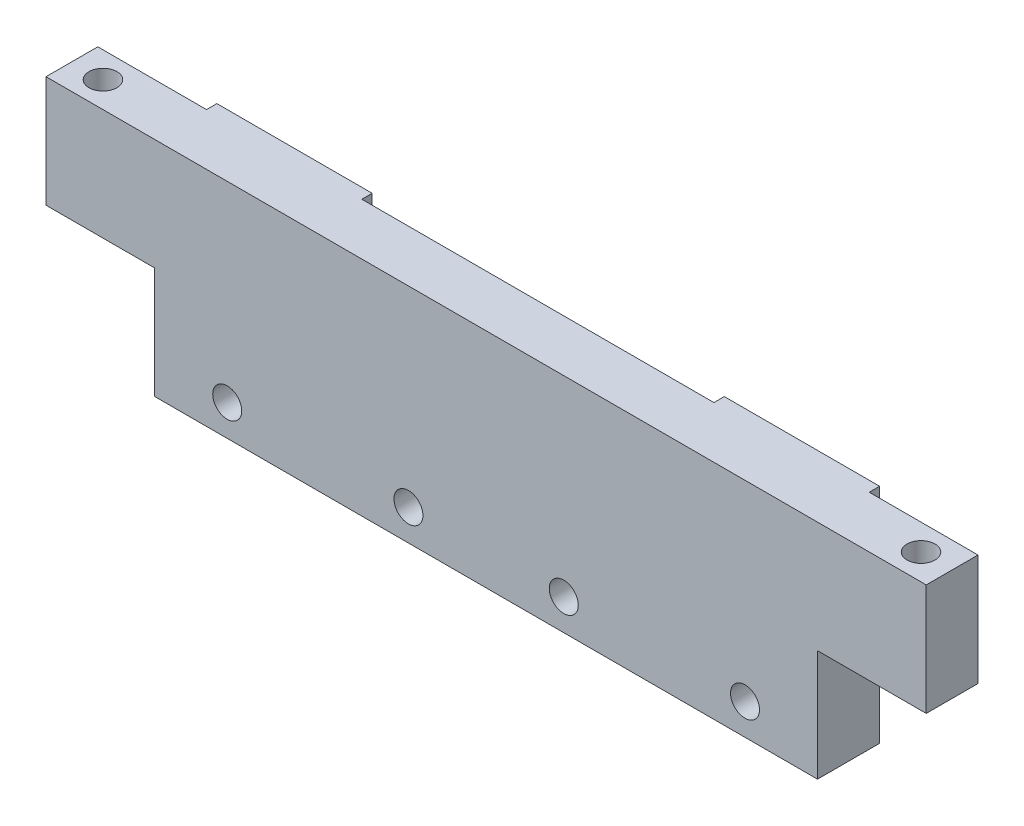
ISO-10303-21;
HEADER;
FILE_DESCRIPTION(('STEP AP214'),'2;1');
FILE_NAME('part.step','',(''),(''),'','','');
FILE_SCHEMA(('AUTOMOTIVE_DESIGN { 1 0 10303 214 1 1 1 1 }'));
ENDSEC;
DATA;
#1=APPLICATION_CONTEXT('core data for automotive mechanical design processes');
#2=APPLICATION_PROTOCOL_DEFINITION('international standard','automotive_design',2000,#1);
#3=PRODUCT_CONTEXT('',#1,'mechanical');
#4=PRODUCT('Part','Part','',(#3));
#5=PRODUCT_RELATED_PRODUCT_CATEGORY('part','',(#4));
#6=PRODUCT_DEFINITION_FORMATION('','',#4);
#7=PRODUCT_DEFINITION_CONTEXT('part definition',#1,'design');
#8=PRODUCT_DEFINITION('design','',#6,#7);
#9=PRODUCT_DEFINITION_SHAPE('','',#8);
#10=(LENGTH_UNIT() NAMED_UNIT(*) SI_UNIT(.MILLI.,.METRE.));
#11=(NAMED_UNIT(*) PLANE_ANGLE_UNIT() SI_UNIT($,.RADIAN.));
#12=(NAMED_UNIT(*) SI_UNIT($,.STERADIAN.) SOLID_ANGLE_UNIT());
#13=UNCERTAINTY_MEASURE_WITH_UNIT(LENGTH_MEASURE(1.E-05),#10,'distance_accuracy_value','');
#14=(GEOMETRIC_REPRESENTATION_CONTEXT(3) GLOBAL_UNCERTAINTY_ASSIGNED_CONTEXT((#13)) GLOBAL_UNIT_ASSIGNED_CONTEXT((#10,
#11,#12)) REPRESENTATION_CONTEXT('',''));
#15=CARTESIAN_POINT('',(0.,0.,0.));
#16=DIRECTION('',(0.,0.,1.));
#17=DIRECTION('',(1.,0.,0.));
#18=AXIS2_PLACEMENT_3D('',#15,#16,#17);
#19=CARTESIAN_POINT('',(0.,21.5,0.));
#20=DIRECTION('',(0.,-1.,0.));
#21=DIRECTION('',(0.,0.,-1.));
#22=AXIS2_PLACEMENT_3D('',#19,#20,#21);
#23=PLANE('',#22);
#24=DIRECTION('',(-1.,0.,0.));
#25=VECTOR('',#24,1.);
#26=CARTESIAN_POINT('',(-32.,21.5,-2.5));
#27=LINE('',#26,#25);
#28=CARTESIAN_POINT('',(-32.,21.5,-2.5));
#29=VERTEX_POINT('',#28);
#30=CARTESIAN_POINT('',(-42.5,21.5,-2.5));
#31=VERTEX_POINT('',#30);
#32=EDGE_CURVE('E168',#29,#31,#27,.T.);
#33=ORIENTED_EDGE('',*,*,#32,.T.);
#34=DIRECTION('',(0.,0.,1.));
#35=VECTOR('',#34,1.);
#36=CARTESIAN_POINT('',(-42.5,21.5,2.5));
#37=LINE('',#36,#35);
#38=CARTESIAN_POINT('',(-42.5,21.5,2.5));
#39=VERTEX_POINT('',#38);
#40=EDGE_CURVE('E99',#31,#39,#37,.T.);
#41=ORIENTED_EDGE('',*,*,#40,.T.);
#42=DIRECTION('',(1.,0.,0.));
#43=VECTOR('',#42,1.);
#44=CARTESIAN_POINT('',(42.5,21.5,2.5));
#45=LINE('',#44,#43);
#46=CARTESIAN_POINT('',(42.5,21.5,2.5));
#47=VERTEX_POINT('',#46);
#48=EDGE_CURVE('E254',#39,#47,#45,.T.);
#49=ORIENTED_EDGE('',*,*,#48,.T.);
#50=DIRECTION('',(0.,0.,-1.));
#51=VECTOR('',#50,1.);
#52=CARTESIAN_POINT('',(42.5,21.5,2.5));
#53=LINE('',#52,#51);
#54=CARTESIAN_POINT('',(42.5,21.5,-2.50000000000001));
#55=VERTEX_POINT('',#54);
#56=EDGE_CURVE('E256',#47,#55,#53,.T.);
#57=ORIENTED_EDGE('',*,*,#56,.T.);
#58=DIRECTION('',(-1.,0.,0.));
#59=VECTOR('',#58,1.);
#60=CARTESIAN_POINT('',(42.5,21.5,-2.50000000000001));
#61=LINE('',#60,#59);
#62=CARTESIAN_POINT('',(32.,21.5,-2.5));
#63=VERTEX_POINT('',#62);
#64=EDGE_CURVE('E258',#55,#63,#61,.T.);
#65=ORIENTED_EDGE('',*,*,#64,.T.);
#66=DIRECTION('',(0.,0.,-1.));
#67=VECTOR('',#66,1.);
#68=CARTESIAN_POINT('',(32.,21.5,-2.5));
#69=LINE('',#68,#67);
#70=CARTESIAN_POINT('',(32.,21.5,-3.5));
#71=VERTEX_POINT('',#70);
#72=EDGE_CURVE('E260',#63,#71,#69,.T.);
#73=ORIENTED_EDGE('',*,*,#72,.T.);
#74=DIRECTION('',(-1.,0.,0.));
#75=VECTOR('',#74,1.);
#76=CARTESIAN_POINT('',(32.,21.5,-3.5));
#77=LINE('',#76,#75);
#78=CARTESIAN_POINT('',(17.,21.5,-3.49999999999999));
#79=VERTEX_POINT('',#78);
#80=EDGE_CURVE('E262',#71,#79,#77,.T.);
#81=ORIENTED_EDGE('',*,*,#80,.T.);
#82=DIRECTION('',(0.,0.,1.));
#83=VECTOR('',#82,1.);
#84=CARTESIAN_POINT('',(17.,21.5,-2.5));
#85=LINE('',#84,#83);
#86=CARTESIAN_POINT('',(17.,21.5,-2.5));
#87=VERTEX_POINT('',#86);
#88=EDGE_CURVE('E264',#79,#87,#85,.T.);
#89=ORIENTED_EDGE('',*,*,#88,.T.);
#90=DIRECTION('',(-1.,0.,0.));
#91=VECTOR('',#90,1.);
#92=CARTESIAN_POINT('',(17.,21.5,-2.5));
#93=LINE('',#92,#91);
#94=CARTESIAN_POINT('',(-17.,21.5,-2.5));
#95=VERTEX_POINT('',#94);
#96=EDGE_CURVE('E133',#87,#95,#93,.T.);
#97=ORIENTED_EDGE('',*,*,#96,.T.);
#98=DIRECTION('',(0.,0.,-1.));
#99=VECTOR('',#98,1.);
#100=CARTESIAN_POINT('',(-17.,21.5,-2.5));
#101=LINE('',#100,#99);
#102=CARTESIAN_POINT('',(-17.,21.5,-3.5));
#103=VERTEX_POINT('',#102);
#104=EDGE_CURVE('E127',#95,#103,#101,.T.);
#105=ORIENTED_EDGE('',*,*,#104,.T.);
#106=DIRECTION('',(-1.,0.,0.));
#107=VECTOR('',#106,1.);
#108=CARTESIAN_POINT('',(-32.,21.5,-3.5));
#109=LINE('',#108,#107);
#110=CARTESIAN_POINT('',(-32.,21.5,-3.5));
#111=VERTEX_POINT('',#110);
#112=EDGE_CURVE('E131',#103,#111,#109,.T.);
#113=ORIENTED_EDGE('',*,*,#112,.T.);
#114=DIRECTION('',(0.,0.,1.));
#115=VECTOR('',#114,1.);
#116=CARTESIAN_POINT('',(-32.,21.5,-2.5));
#117=LINE('',#116,#115);
#118=EDGE_CURVE('E63',#111,#29,#117,.T.);
#119=ORIENTED_EDGE('',*,*,#118,.T.);
#120=EDGE_LOOP('',(#33,#41,#49,#57,#65,#73,#81,#89,#97,#105,#113,#119));
#121=FACE_BOUND('',#120,.T.);
#122=CARTESIAN_POINT('',(-39.5,21.5,0.));
#123=DIRECTION('',(0.,1.,0.));
#124=DIRECTION('',(0.,0.,1.));
#125=AXIS2_PLACEMENT_3D('',#122,#123,#124);
#126=CIRCLE('',#125,1.35);
#127=CARTESIAN_POINT('',(-39.5,21.5,1.35));
#128=VERTEX_POINT('',#127);
#129=EDGE_CURVE('E155',#128,#128,#126,.T.);
#130=ORIENTED_EDGE('',*,*,#129,.F.);
#131=EDGE_LOOP('',(#130));
#132=FACE_BOUND('',#131,.T.);
#133=CARTESIAN_POINT('',(39.5,21.5,0.));
#134=DIRECTION('',(0.,1.,0.));
#135=DIRECTION('',(0.,0.,1.));
#136=AXIS2_PLACEMENT_3D('',#133,#134,#135);
#137=CIRCLE('',#136,1.35);
#138=CARTESIAN_POINT('',(39.5,21.5,1.34999999999998));
#139=VERTEX_POINT('',#138);
#140=EDGE_CURVE('E205',#139,#139,#137,.T.);
#141=ORIENTED_EDGE('',*,*,#140,.F.);
#142=EDGE_LOOP('',(#141));
#143=FACE_BOUND('',#142,.T.);
#144=ADVANCED_FACE('F37',(#121,#132,#143),#23,.F.);
#145=CARTESIAN_POINT('',(0.,0.,0.));
#146=DIRECTION('',(0.,-1.,0.));
#147=DIRECTION('',(0.,0.,-1.));
#148=AXIS2_PLACEMENT_3D('',#145,#146,#147);
#149=PLANE('',#148);
#150=DIRECTION('',(0.,0.,-1.));
#151=VECTOR('',#150,1.);
#152=CARTESIAN_POINT('',(32.,0.,-2.5));
#153=LINE('',#152,#151);
#154=CARTESIAN_POINT('',(32.,0.,2.50000000000002));
#155=VERTEX_POINT('',#154);
#156=CARTESIAN_POINT('',(32.,0.,-3.5));
#157=VERTEX_POINT('',#156);
#158=EDGE_CURVE('E154',#155,#157,#153,.T.);
#159=ORIENTED_EDGE('',*,*,#158,.F.);
#160=DIRECTION('',(1.,0.,0.));
#161=VECTOR('',#160,1.);
#162=CARTESIAN_POINT('',(42.5,0.,2.5));
#163=LINE('',#162,#161);
#164=CARTESIAN_POINT('',(-32.,0.,2.5));
#165=VERTEX_POINT('',#164);
#166=EDGE_CURVE('E151',#165,#155,#163,.T.);
#167=ORIENTED_EDGE('',*,*,#166,.F.);
#168=DIRECTION('',(0.,0.,1.));
#169=VECTOR('',#168,1.);
#170=CARTESIAN_POINT('',(-32.,0.,-2.5));
#171=LINE('',#170,#169);
#172=CARTESIAN_POINT('',(-32.,0.,-3.5));
#173=VERTEX_POINT('',#172);
#174=EDGE_CURVE('E165',#173,#165,#171,.T.);
#175=ORIENTED_EDGE('',*,*,#174,.F.);
#176=DIRECTION('',(-1.,0.,0.));
#177=VECTOR('',#176,1.);
#178=CARTESIAN_POINT('',(-32.,0.,-3.5));
#179=LINE('',#178,#177);
#180=CARTESIAN_POINT('',(-17.,0.,-3.5));
#181=VERTEX_POINT('',#180);
#182=EDGE_CURVE('E91',#181,#173,#179,.T.);
#183=ORIENTED_EDGE('',*,*,#182,.F.);
#184=DIRECTION('',(0.,0.,-1.));
#185=VECTOR('',#184,1.);
#186=CARTESIAN_POINT('',(-17.,0.,-2.5));
#187=LINE('',#186,#185);
#188=CARTESIAN_POINT('',(-17.,0.,-2.5));
#189=VERTEX_POINT('',#188);
#190=EDGE_CURVE('E141',#189,#181,#187,.T.);
#191=ORIENTED_EDGE('',*,*,#190,.F.);
#192=DIRECTION('',(-1.,0.,0.));
#193=VECTOR('',#192,1.);
#194=CARTESIAN_POINT('',(17.,0.,-2.5));
#195=LINE('',#194,#193);
#196=CARTESIAN_POINT('',(17.,0.,-2.5));
#197=VERTEX_POINT('',#196);
#198=EDGE_CURVE('E161',#197,#189,#195,.T.);
#199=ORIENTED_EDGE('',*,*,#198,.F.);
#200=DIRECTION('',(0.,0.,1.));
#201=VECTOR('',#200,1.);
#202=CARTESIAN_POINT('',(17.,0.,-2.5));
#203=LINE('',#202,#201);
#204=CARTESIAN_POINT('',(17.,0.,-3.49999999999999));
#205=VERTEX_POINT('',#204);
#206=EDGE_CURVE('E159',#205,#197,#203,.T.);
#207=ORIENTED_EDGE('',*,*,#206,.F.);
#208=DIRECTION('',(-1.,0.,0.));
#209=VECTOR('',#208,1.);
#210=CARTESIAN_POINT('',(32.,0.,-3.5));
#211=LINE('',#210,#209);
#212=EDGE_CURVE('E157',#157,#205,#211,.T.);
#213=ORIENTED_EDGE('',*,*,#212,.F.);
#214=EDGE_LOOP('',(#159,#167,#175,#183,#191,#199,#207,#213));
#215=FACE_BOUND('',#214,.T.);
#216=ADVANCED_FACE('F277',(#215),#149,.T.);
#217=CARTESIAN_POINT('',(-32.,21.5,-2.5));
#218=DIRECTION('',(0.,0.,1.));
#219=DIRECTION('',(1.,0.,0.));
#220=AXIS2_PLACEMENT_3D('',#217,#218,#219);
#221=PLANE('',#220);
#222=DIRECTION('',(0.,-1.,0.));
#223=VECTOR('',#222,1.);
#224=CARTESIAN_POINT('',(-32.,21.5,-2.5));
#225=LINE('',#224,#223);
#226=CARTESIAN_POINT('',(-32.,10.75,-2.5));
#227=VERTEX_POINT('',#226);
#228=EDGE_CURVE('E147',#29,#227,#225,.T.);
#229=ORIENTED_EDGE('',*,*,#228,.T.);
#230=DIRECTION('',(1.,0.,0.));
#231=VECTOR('',#230,1.);
#232=CARTESIAN_POINT('',(-32.,10.75,-2.5));
#233=LINE('',#232,#231);
#234=CARTESIAN_POINT('',(-42.5,10.75,-2.5));
#235=VERTEX_POINT('',#234);
#236=EDGE_CURVE('E54',#235,#227,#233,.T.);
#237=ORIENTED_EDGE('',*,*,#236,.F.);
#238=DIRECTION('',(0.,-1.,0.));
#239=VECTOR('',#238,1.);
#240=CARTESIAN_POINT('',(-42.5,21.5,-2.5));
#241=LINE('',#240,#239);
#242=EDGE_CURVE('E11',#31,#235,#241,.T.);
#243=ORIENTED_EDGE('',*,*,#242,.F.);
#244=ORIENTED_EDGE('',*,*,#32,.F.);
#245=EDGE_LOOP('',(#229,#237,#243,#244));
#246=FACE_BOUND('',#245,.T.);
#247=ADVANCED_FACE('F39',(#246),#221,.F.);
#248=CARTESIAN_POINT('',(-42.5,21.5,2.5));
#249=DIRECTION('',(1.,0.,0.));
#250=DIRECTION('',(0.,0.,-1.));
#251=AXIS2_PLACEMENT_3D('',#248,#249,#250);
#252=PLANE('',#251);
#253=ORIENTED_EDGE('',*,*,#242,.T.);
#254=DIRECTION('',(0.,0.,-1.));
#255=VECTOR('',#254,1.);
#256=CARTESIAN_POINT('',(-42.5,10.75,2.5));
#257=LINE('',#256,#255);
#258=CARTESIAN_POINT('',(-42.5,10.75,2.5));
#259=VERTEX_POINT('',#258);
#260=EDGE_CURVE('E227',#259,#235,#257,.T.);
#261=ORIENTED_EDGE('',*,*,#260,.F.);
#262=DIRECTION('',(0.,-1.,0.));
#263=VECTOR('',#262,1.);
#264=CARTESIAN_POINT('',(-42.5,21.5,2.5));
#265=LINE('',#264,#263);
#266=EDGE_CURVE('E46',#39,#259,#265,.T.);
#267=ORIENTED_EDGE('',*,*,#266,.F.);
#268=ORIENTED_EDGE('',*,*,#40,.F.);
#269=EDGE_LOOP('',(#253,#261,#267,#268));
#270=FACE_BOUND('',#269,.T.);
#271=ADVANCED_FACE('F294',(#270),#252,.F.);
#272=CARTESIAN_POINT('',(42.5,21.5,2.5));
#273=DIRECTION('',(0.,0.,-1.));
#274=DIRECTION('',(-1.,0.,0.));
#275=AXIS2_PLACEMENT_3D('',#272,#273,#274);
#276=PLANE('',#275);
#277=CARTESIAN_POINT('',(-25.,3.,2.5));
#278=DIRECTION('',(0.,0.,-1.));
#279=DIRECTION('',(-1.,0.,0.));
#280=AXIS2_PLACEMENT_3D('',#277,#278,#279);
#281=CIRCLE('',#280,1.4);
#282=CARTESIAN_POINT('',(-26.4,3.,2.5));
#283=VERTEX_POINT('',#282);
#284=EDGE_CURVE('E212',#283,#283,#281,.T.);
#285=ORIENTED_EDGE('',*,*,#284,.T.);
#286=EDGE_LOOP('',(#285));
#287=FACE_BOUND('',#286,.T.);
#288=CARTESIAN_POINT('',(25.,3.,2.5));
#289=DIRECTION('',(0.,0.,-1.));
#290=DIRECTION('',(-1.,0.,0.));
#291=AXIS2_PLACEMENT_3D('',#288,#289,#290);
#292=CIRCLE('',#291,1.4);
#293=CARTESIAN_POINT('',(23.6,3.,2.5));
#294=VERTEX_POINT('',#293);
#295=EDGE_CURVE('E241',#294,#294,#292,.T.);
#296=ORIENTED_EDGE('',*,*,#295,.T.);
#297=EDGE_LOOP('',(#296));
#298=FACE_BOUND('',#297,.T.);
#299=CARTESIAN_POINT('',(-7.5,3.,2.5));
#300=DIRECTION('',(0.,0.,-1.));
#301=DIRECTION('',(-1.,0.,0.));
#302=AXIS2_PLACEMENT_3D('',#299,#300,#301);
#303=CIRCLE('',#302,1.4);
#304=CARTESIAN_POINT('',(-8.9,3.,2.5));
#305=VERTEX_POINT('',#304);
#306=EDGE_CURVE('E238',#305,#305,#303,.T.);
#307=ORIENTED_EDGE('',*,*,#306,.T.);
#308=EDGE_LOOP('',(#307));
#309=FACE_BOUND('',#308,.T.);
#310=CARTESIAN_POINT('',(7.5,3.,2.5));
#311=DIRECTION('',(0.,0.,-1.));
#312=DIRECTION('',(-1.,0.,0.));
#313=AXIS2_PLACEMENT_3D('',#310,#311,#312);
#314=CIRCLE('',#313,1.4);
#315=CARTESIAN_POINT('',(6.1,3.,2.5));
#316=VERTEX_POINT('',#315);
#317=EDGE_CURVE('E197',#316,#316,#314,.T.);
#318=ORIENTED_EDGE('',*,*,#317,.T.);
#319=EDGE_LOOP('',(#318));
#320=FACE_BOUND('',#319,.T.);
#321=ORIENTED_EDGE('',*,*,#166,.T.);
#322=DIRECTION('',(0.,1.,0.));
#323=VECTOR('',#322,1.);
#324=CARTESIAN_POINT('',(32.,10.75,2.50000000000002));
#325=LINE('',#324,#323);
#326=CARTESIAN_POINT('',(32.,10.75,2.50000000000002));
#327=VERTEX_POINT('',#326);
#328=EDGE_CURVE('E321',#155,#327,#325,.T.);
#329=ORIENTED_EDGE('',*,*,#328,.T.);
#330=DIRECTION('',(1.,0.,0.));
#331=VECTOR('',#330,1.);
#332=CARTESIAN_POINT('',(32.,10.75,2.50000000000002));
#333=LINE('',#332,#331);
#334=CARTESIAN_POINT('',(42.5,10.75,2.50000000000002));
#335=VERTEX_POINT('',#334);
#336=EDGE_CURVE('E221',#327,#335,#333,.T.);
#337=ORIENTED_EDGE('',*,*,#336,.T.);
#338=DIRECTION('',(0.,-1.,0.));
#339=VECTOR('',#338,1.);
#340=CARTESIAN_POINT('',(42.5,21.5,2.5));
#341=LINE('',#340,#339);
#342=EDGE_CURVE('E188',#47,#335,#341,.T.);
#343=ORIENTED_EDGE('',*,*,#342,.F.);
#344=ORIENTED_EDGE('',*,*,#48,.F.);
#345=ORIENTED_EDGE('',*,*,#266,.T.);
#346=DIRECTION('',(1.,0.,0.));
#347=VECTOR('',#346,1.);
#348=CARTESIAN_POINT('',(-32.,10.75,2.5));
#349=LINE('',#348,#347);
#350=CARTESIAN_POINT('',(-32.,10.75,2.5));
#351=VERTEX_POINT('',#350);
#352=EDGE_CURVE('E229',#259,#351,#349,.T.);
#353=ORIENTED_EDGE('',*,*,#352,.T.);
#354=DIRECTION('',(0.,-1.,0.));
#355=VECTOR('',#354,1.);
#356=CARTESIAN_POINT('',(-32.,10.75,2.5));
#357=LINE('',#356,#355);
#358=EDGE_CURVE('E233',#351,#165,#357,.T.);
#359=ORIENTED_EDGE('',*,*,#358,.T.);
#360=EDGE_LOOP('',(#321,#329,#337,#343,#344,#345,#353,#359));
#361=FACE_BOUND('',#360,.T.);
#362=ADVANCED_FACE('F287',(#287,#298,#309,#320,#361),#276,.F.);
#363=CARTESIAN_POINT('',(42.5,21.5,2.5));
#364=DIRECTION('',(-1.,0.,0.));
#365=DIRECTION('',(0.,0.,1.));
#366=AXIS2_PLACEMENT_3D('',#363,#364,#365);
#367=PLANE('',#366);
#368=ORIENTED_EDGE('',*,*,#342,.T.);
#369=DIRECTION('',(0.,0.,-1.));
#370=VECTOR('',#369,1.);
#371=CARTESIAN_POINT('',(42.5,10.75,2.50000000000002));
#372=LINE('',#371,#370);
#373=CARTESIAN_POINT('',(42.5,10.75,-2.49999999999998));
#374=VERTEX_POINT('',#373);
#375=EDGE_CURVE('E208',#335,#374,#372,.T.);
#376=ORIENTED_EDGE('',*,*,#375,.T.);
#377=DIRECTION('',(0.,-1.,0.));
#378=VECTOR('',#377,1.);
#379=CARTESIAN_POINT('',(42.5,21.5,-2.50000000000001));
#380=LINE('',#379,#378);
#381=EDGE_CURVE('E185',#55,#374,#380,.T.);
#382=ORIENTED_EDGE('',*,*,#381,.F.);
#383=ORIENTED_EDGE('',*,*,#56,.F.);
#384=EDGE_LOOP('',(#368,#376,#382,#383));
#385=FACE_BOUND('',#384,.T.);
#386=ADVANCED_FACE('F305',(#385),#367,.F.);
#387=CARTESIAN_POINT('',(42.5,21.5,-2.50000000000001));
#388=DIRECTION('',(0.,0.,1.));
#389=DIRECTION('',(1.,0.,0.));
#390=AXIS2_PLACEMENT_3D('',#387,#388,#389);
#391=PLANE('',#390);
#392=ORIENTED_EDGE('',*,*,#381,.T.);
#393=DIRECTION('',(1.,0.,0.));
#394=VECTOR('',#393,1.);
#395=CARTESIAN_POINT('',(32.,10.75,-2.49999999999998));
#396=LINE('',#395,#394);
#397=CARTESIAN_POINT('',(32.,10.75,-2.49999999999998));
#398=VERTEX_POINT('',#397);
#399=EDGE_CURVE('E224',#398,#374,#396,.T.);
#400=ORIENTED_EDGE('',*,*,#399,.F.);
#401=DIRECTION('',(0.,-1.,0.));
#402=VECTOR('',#401,1.);
#403=CARTESIAN_POINT('',(32.,21.5,-2.5));
#404=LINE('',#403,#402);
#405=EDGE_CURVE('E182',#63,#398,#404,.T.);
#406=ORIENTED_EDGE('',*,*,#405,.F.);
#407=ORIENTED_EDGE('',*,*,#64,.F.);
#408=EDGE_LOOP('',(#392,#400,#406,#407));
#409=FACE_BOUND('',#408,.T.);
#410=ADVANCED_FACE('F310',(#409),#391,.F.);
#411=CARTESIAN_POINT('',(32.,21.5,-2.5));
#412=DIRECTION('',(-1.,0.,0.));
#413=DIRECTION('',(0.,0.,1.));
#414=AXIS2_PLACEMENT_3D('',#411,#412,#413);
#415=PLANE('',#414);
#416=ORIENTED_EDGE('',*,*,#158,.T.);
#417=DIRECTION('',(0.,-1.,0.));
#418=VECTOR('',#417,1.);
#419=CARTESIAN_POINT('',(32.,21.5,-3.5));
#420=LINE('',#419,#418);
#421=EDGE_CURVE('E179',#71,#157,#420,.T.);
#422=ORIENTED_EDGE('',*,*,#421,.F.);
#423=ORIENTED_EDGE('',*,*,#72,.F.);
#424=ORIENTED_EDGE('',*,*,#405,.T.);
#425=DIRECTION('',(0.,0.,-1.));
#426=VECTOR('',#425,1.);
#427=CARTESIAN_POINT('',(32.,10.75,2.50000000000002));
#428=LINE('',#427,#426);
#429=EDGE_CURVE('E214',#327,#398,#428,.T.);
#430=ORIENTED_EDGE('',*,*,#429,.F.);
#431=ORIENTED_EDGE('',*,*,#328,.F.);
#432=EDGE_LOOP('',(#416,#422,#423,#424,#430,#431));
#433=FACE_BOUND('',#432,.T.);
#434=ADVANCED_FACE('F314',(#433),#415,.F.);
#435=CARTESIAN_POINT('',(32.,21.5,-3.5));
#436=DIRECTION('',(0.,0.,1.));
#437=DIRECTION('',(1.,0.,0.));
#438=AXIS2_PLACEMENT_3D('',#435,#436,#437);
#439=PLANE('',#438);
#440=CARTESIAN_POINT('',(25.,3.,-3.5));
#441=DIRECTION('',(0.,0.,1.));
#442=DIRECTION('',(1.,0.,0.));
#443=AXIS2_PLACEMENT_3D('',#440,#441,#442);
#444=CIRCLE('',#443,1.4);
#445=CARTESIAN_POINT('',(26.4,3.,-3.5));
#446=VERTEX_POINT('',#445);
#447=EDGE_CURVE('E203',#446,#446,#444,.F.);
#448=ORIENTED_EDGE('',*,*,#447,.F.);
#449=EDGE_LOOP('',(#448));
#450=FACE_BOUND('',#449,.T.);
#451=ORIENTED_EDGE('',*,*,#212,.T.);
#452=DIRECTION('',(0.,-1.,0.));
#453=VECTOR('',#452,1.);
#454=CARTESIAN_POINT('',(17.,21.5,-3.49999999999999));
#455=LINE('',#454,#453);
#456=EDGE_CURVE('E176',#79,#205,#455,.T.);
#457=ORIENTED_EDGE('',*,*,#456,.F.);
#458=ORIENTED_EDGE('',*,*,#80,.F.);
#459=ORIENTED_EDGE('',*,*,#421,.T.);
#460=EDGE_LOOP('',(#451,#457,#458,#459));
#461=FACE_BOUND('',#460,.T.);
#462=ADVANCED_FACE('F318',(#450,#461),#439,.F.);
#463=CARTESIAN_POINT('',(17.,21.5,-2.5));
#464=DIRECTION('',(1.,0.,0.));
#465=DIRECTION('',(0.,0.,-1.));
#466=AXIS2_PLACEMENT_3D('',#463,#464,#465);
#467=PLANE('',#466);
#468=ORIENTED_EDGE('',*,*,#206,.T.);
#469=DIRECTION('',(0.,-1.,0.));
#470=VECTOR('',#469,1.);
#471=CARTESIAN_POINT('',(17.,21.5,-2.5));
#472=LINE('',#471,#470);
#473=EDGE_CURVE('E173',#87,#197,#472,.T.);
#474=ORIENTED_EDGE('',*,*,#473,.F.);
#475=ORIENTED_EDGE('',*,*,#88,.F.);
#476=ORIENTED_EDGE('',*,*,#456,.T.);
#477=EDGE_LOOP('',(#468,#474,#475,#476));
#478=FACE_BOUND('',#477,.T.);
#479=ADVANCED_FACE('F270',(#478),#467,.F.);
#480=CARTESIAN_POINT('',(17.,21.5,-2.5));
#481=DIRECTION('',(0.,0.,1.));
#482=DIRECTION('',(1.,0.,0.));
#483=AXIS2_PLACEMENT_3D('',#480,#481,#482);
#484=PLANE('',#483);
#485=CARTESIAN_POINT('',(-7.5,3.,-2.5));
#486=DIRECTION('',(0.,0.,1.));
#487=DIRECTION('',(1.,0.,0.));
#488=AXIS2_PLACEMENT_3D('',#485,#486,#487);
#489=CIRCLE('',#488,1.4);
#490=CARTESIAN_POINT('',(-6.1,3.,-2.5));
#491=VERTEX_POINT('',#490);
#492=EDGE_CURVE('E200',#491,#491,#489,.F.);
#493=ORIENTED_EDGE('',*,*,#492,.F.);
#494=EDGE_LOOP('',(#493));
#495=FACE_BOUND('',#494,.T.);
#496=CARTESIAN_POINT('',(7.5,3.,-2.5));
#497=DIRECTION('',(0.,0.,1.));
#498=DIRECTION('',(1.,0.,0.));
#499=AXIS2_PLACEMENT_3D('',#496,#497,#498);
#500=CIRCLE('',#499,1.4);
#501=CARTESIAN_POINT('',(8.9,3.,-2.5));
#502=VERTEX_POINT('',#501);
#503=EDGE_CURVE('E196',#502,#502,#500,.F.);
#504=ORIENTED_EDGE('',*,*,#503,.F.);
#505=EDGE_LOOP('',(#504));
#506=FACE_BOUND('',#505,.T.);
#507=ORIENTED_EDGE('',*,*,#198,.T.);
#508=DIRECTION('',(0.,-1.,0.));
#509=VECTOR('',#508,1.);
#510=CARTESIAN_POINT('',(-17.,21.5,-2.5));
#511=LINE('',#510,#509);
#512=EDGE_CURVE('E142',#95,#189,#511,.T.);
#513=ORIENTED_EDGE('',*,*,#512,.F.);
#514=ORIENTED_EDGE('',*,*,#96,.F.);
#515=ORIENTED_EDGE('',*,*,#473,.T.);
#516=EDGE_LOOP('',(#507,#513,#514,#515));
#517=FACE_BOUND('',#516,.T.);
#518=ADVANCED_FACE('F274',(#495,#506,#517),#484,.F.);
#519=CARTESIAN_POINT('',(-17.,21.5,-2.5));
#520=DIRECTION('',(-1.,0.,0.));
#521=DIRECTION('',(0.,0.,1.));
#522=AXIS2_PLACEMENT_3D('',#519,#520,#521);
#523=PLANE('',#522);
#524=ORIENTED_EDGE('',*,*,#190,.T.);
#525=DIRECTION('',(0.,-1.,0.));
#526=VECTOR('',#525,1.);
#527=CARTESIAN_POINT('',(-17.,21.5,-3.5));
#528=LINE('',#527,#526);
#529=EDGE_CURVE('E138',#103,#181,#528,.T.);
#530=ORIENTED_EDGE('',*,*,#529,.F.);
#531=ORIENTED_EDGE('',*,*,#104,.F.);
#532=ORIENTED_EDGE('',*,*,#512,.T.);
#533=EDGE_LOOP('',(#524,#530,#531,#532));
#534=FACE_BOUND('',#533,.T.);
#535=ADVANCED_FACE('F139',(#534),#523,.F.);
#536=CARTESIAN_POINT('',(-32.,21.5,-3.5));
#537=DIRECTION('',(0.,0.,1.));
#538=DIRECTION('',(1.,0.,0.));
#539=AXIS2_PLACEMENT_3D('',#536,#537,#538);
#540=PLANE('',#539);
#541=CARTESIAN_POINT('',(-25.,3.,-3.5));
#542=DIRECTION('',(0.,0.,1.));
#543=DIRECTION('',(1.,0.,0.));
#544=AXIS2_PLACEMENT_3D('',#541,#542,#543);
#545=CIRCLE('',#544,1.4);
#546=CARTESIAN_POINT('',(-23.6,3.,-3.5));
#547=VERTEX_POINT('',#546);
#548=EDGE_CURVE('E193',#547,#547,#545,.F.);
#549=ORIENTED_EDGE('',*,*,#548,.F.);
#550=EDGE_LOOP('',(#549));
#551=FACE_BOUND('',#550,.T.);
#552=ORIENTED_EDGE('',*,*,#182,.T.);
#553=DIRECTION('',(0.,-1.,0.));
#554=VECTOR('',#553,1.);
#555=CARTESIAN_POINT('',(-32.,21.5,-3.5));
#556=LINE('',#555,#554);
#557=EDGE_CURVE('E143',#111,#173,#556,.T.);
#558=ORIENTED_EDGE('',*,*,#557,.F.);
#559=ORIENTED_EDGE('',*,*,#112,.F.);
#560=ORIENTED_EDGE('',*,*,#529,.T.);
#561=EDGE_LOOP('',(#552,#558,#559,#560));
#562=FACE_BOUND('',#561,.T.);
#563=ADVANCED_FACE('F145',(#551,#562),#540,.F.);
#564=CARTESIAN_POINT('',(-32.,21.5,-2.5));
#565=DIRECTION('',(1.,0.,0.));
#566=DIRECTION('',(0.,0.,-1.));
#567=AXIS2_PLACEMENT_3D('',#564,#565,#566);
#568=PLANE('',#567);
#569=ORIENTED_EDGE('',*,*,#174,.T.);
#570=ORIENTED_EDGE('',*,*,#358,.F.);
#571=DIRECTION('',(0.,0.,-1.));
#572=VECTOR('',#571,1.);
#573=CARTESIAN_POINT('',(-32.,10.75,2.5));
#574=LINE('',#573,#572);
#575=EDGE_CURVE('E230',#351,#227,#574,.T.);
#576=ORIENTED_EDGE('',*,*,#575,.T.);
#577=ORIENTED_EDGE('',*,*,#228,.F.);
#578=ORIENTED_EDGE('',*,*,#118,.F.);
#579=ORIENTED_EDGE('',*,*,#557,.T.);
#580=EDGE_LOOP('',(#569,#570,#576,#577,#578,#579));
#581=FACE_BOUND('',#580,.T.);
#582=ADVANCED_FACE('F282',(#581),#568,.F.);
#583=CARTESIAN_POINT('',(-39.5,21.5,0.));
#584=DIRECTION('',(0.,-1.,0.));
#585=DIRECTION('',(0.,0.,-1.));
#586=AXIS2_PLACEMENT_3D('',#583,#584,#585);
#587=CYLINDRICAL_SURFACE('',#586,1.35);
#588=CARTESIAN_POINT('',(-39.5,10.75,0.));
#589=DIRECTION('',(0.,1.,0.));
#590=DIRECTION('',(0.,0.,1.));
#591=AXIS2_PLACEMENT_3D('',#588,#589,#590);
#592=CIRCLE('',#591,1.35);
#593=CARTESIAN_POINT('',(-39.5,10.75,1.35));
#594=VERTEX_POINT('',#593);
#595=EDGE_CURVE('E41',#594,#594,#592,.T.);
#596=ORIENTED_EDGE('',*,*,#595,.F.);
#597=EDGE_LOOP('',(#596));
#598=FACE_BOUND('',#597,.T.);
#599=ORIENTED_EDGE('',*,*,#129,.T.);
#600=EDGE_LOOP('',(#599));
#601=FACE_BOUND('',#600,.T.);
#602=ADVANCED_FACE('F350',(#598,#601),#587,.F.);
#603=CARTESIAN_POINT('',(39.5,21.5,0.));
#604=DIRECTION('',(0.,-1.,0.));
#605=DIRECTION('',(0.,0.,-1.));
#606=AXIS2_PLACEMENT_3D('',#603,#604,#605);
#607=CYLINDRICAL_SURFACE('',#606,1.35);
#608=CARTESIAN_POINT('',(39.5,10.75,0.));
#609=DIRECTION('',(0.,1.,0.));
#610=DIRECTION('',(0.,0.,1.));
#611=AXIS2_PLACEMENT_3D('',#608,#609,#610);
#612=CIRCLE('',#611,1.35);
#613=CARTESIAN_POINT('',(39.5,10.75,1.34999999999998));
#614=VERTEX_POINT('',#613);
#615=EDGE_CURVE('E206',#614,#614,#612,.T.);
#616=ORIENTED_EDGE('',*,*,#615,.F.);
#617=EDGE_LOOP('',(#616));
#618=FACE_BOUND('',#617,.T.);
#619=ORIENTED_EDGE('',*,*,#140,.T.);
#620=EDGE_LOOP('',(#619));
#621=FACE_BOUND('',#620,.T.);
#622=ADVANCED_FACE('F427',(#618,#621),#607,.F.);
#623=CARTESIAN_POINT('',(-25.,3.,-19.));
#624=DIRECTION('',(0.,0.,1.));
#625=DIRECTION('',(1.,0.,0.));
#626=AXIS2_PLACEMENT_3D('',#623,#624,#625);
#627=CYLINDRICAL_SURFACE('',#626,1.4);
#628=ORIENTED_EDGE('',*,*,#284,.F.);
#629=EDGE_LOOP('',(#628));
#630=FACE_BOUND('',#629,.T.);
#631=ORIENTED_EDGE('',*,*,#548,.T.);
#632=EDGE_LOOP('',(#631));
#633=FACE_BOUND('',#632,.T.);
#634=ADVANCED_FACE('F416',(#630,#633),#627,.F.);
#635=CARTESIAN_POINT('',(7.5,3.,-19.));
#636=DIRECTION('',(0.,0.,1.));
#637=DIRECTION('',(1.,0.,0.));
#638=AXIS2_PLACEMENT_3D('',#635,#636,#637);
#639=CYLINDRICAL_SURFACE('',#638,1.4);
#640=ORIENTED_EDGE('',*,*,#317,.F.);
#641=EDGE_LOOP('',(#640));
#642=FACE_BOUND('',#641,.T.);
#643=ORIENTED_EDGE('',*,*,#503,.T.);
#644=EDGE_LOOP('',(#643));
#645=FACE_BOUND('',#644,.T.);
#646=ADVANCED_FACE('F405',(#642,#645),#639,.F.);
#647=CARTESIAN_POINT('',(-7.5,3.,-19.));
#648=DIRECTION('',(0.,0.,1.));
#649=DIRECTION('',(1.,0.,0.));
#650=AXIS2_PLACEMENT_3D('',#647,#648,#649);
#651=CYLINDRICAL_SURFACE('',#650,1.4);
#652=ORIENTED_EDGE('',*,*,#306,.F.);
#653=EDGE_LOOP('',(#652));
#654=FACE_BOUND('',#653,.T.);
#655=ORIENTED_EDGE('',*,*,#492,.T.);
#656=EDGE_LOOP('',(#655));
#657=FACE_BOUND('',#656,.T.);
#658=ADVANCED_FACE('F340',(#654,#657),#651,.F.);
#659=CARTESIAN_POINT('',(25.,3.,-19.));
#660=DIRECTION('',(0.,0.,1.));
#661=DIRECTION('',(1.,0.,0.));
#662=AXIS2_PLACEMENT_3D('',#659,#660,#661);
#663=CYLINDRICAL_SURFACE('',#662,1.4);
#664=ORIENTED_EDGE('',*,*,#295,.F.);
#665=EDGE_LOOP('',(#664));
#666=FACE_BOUND('',#665,.T.);
#667=ORIENTED_EDGE('',*,*,#447,.T.);
#668=EDGE_LOOP('',(#667));
#669=FACE_BOUND('',#668,.T.);
#670=ADVANCED_FACE('F332',(#666,#669),#663,.F.);
#671=CARTESIAN_POINT('',(32.,10.75,2.50000000000002));
#672=DIRECTION('',(0.,1.,0.));
#673=DIRECTION('',(0.,0.,1.));
#674=AXIS2_PLACEMENT_3D('',#671,#672,#673);
#675=PLANE('',#674);
#676=ORIENTED_EDGE('',*,*,#615,.T.);
#677=EDGE_LOOP('',(#676));
#678=FACE_BOUND('',#677,.T.);
#679=ORIENTED_EDGE('',*,*,#399,.T.);
#680=ORIENTED_EDGE('',*,*,#375,.F.);
#681=ORIENTED_EDGE('',*,*,#336,.F.);
#682=ORIENTED_EDGE('',*,*,#429,.T.);
#683=EDGE_LOOP('',(#679,#680,#681,#682));
#684=FACE_BOUND('',#683,.T.);
#685=ADVANCED_FACE('F326',(#678,#684),#675,.F.);
#686=CARTESIAN_POINT('',(-32.,10.75,2.5));
#687=DIRECTION('',(0.,1.,0.));
#688=DIRECTION('',(0.,0.,1.));
#689=AXIS2_PLACEMENT_3D('',#686,#687,#688);
#690=PLANE('',#689);
#691=ORIENTED_EDGE('',*,*,#595,.T.);
#692=EDGE_LOOP('',(#691));
#693=FACE_BOUND('',#692,.T.);
#694=ORIENTED_EDGE('',*,*,#236,.T.);
#695=ORIENTED_EDGE('',*,*,#575,.F.);
#696=ORIENTED_EDGE('',*,*,#352,.F.);
#697=ORIENTED_EDGE('',*,*,#260,.T.);
#698=EDGE_LOOP('',(#694,#695,#696,#697));
#699=FACE_BOUND('',#698,.T.);
#700=ADVANCED_FACE('F293',(#693,#699),#690,.F.);
#701=CLOSED_SHELL('',(#144,#216,#247,#271,#362,#386,#410,#434,#462,#479,#518,#535,#563,#582,
#602,#622,#634,#646,#658,#670,#685,#700));
#702=MANIFOLD_SOLID_BREP('B2',#701);
#703=ADVANCED_BREP_SHAPE_REPRESENTATION('',(#18,#702),#14);
#704=SHAPE_DEFINITION_REPRESENTATION(#9,#703);
ENDSEC;
END-ISO-10303-21;
